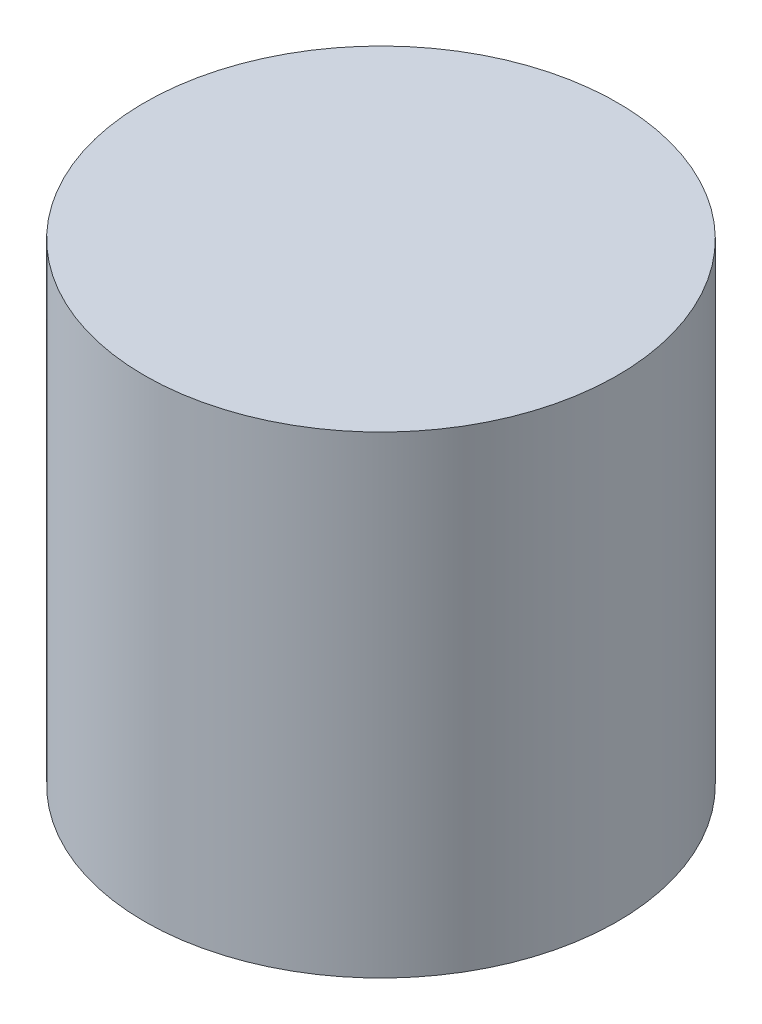
ISO-10303-21;
HEADER;
FILE_DESCRIPTION(('STEP AP214'),'2;1');
FILE_NAME('part.step','',(''),(''),'','','');
FILE_SCHEMA(('AUTOMOTIVE_DESIGN { 1 0 10303 214 1 1 1 1 }'));
ENDSEC;
DATA;
#1=APPLICATION_CONTEXT('core data for automotive mechanical design processes');
#2=APPLICATION_PROTOCOL_DEFINITION('international standard','automotive_design',2000,#1);
#3=PRODUCT_CONTEXT('',#1,'mechanical');
#4=PRODUCT('Part','Part','',(#3));
#5=PRODUCT_RELATED_PRODUCT_CATEGORY('part','',(#4));
#6=PRODUCT_DEFINITION_FORMATION('','',#4);
#7=PRODUCT_DEFINITION_CONTEXT('part definition',#1,'design');
#8=PRODUCT_DEFINITION('design','',#6,#7);
#9=PRODUCT_DEFINITION_SHAPE('','',#8);
#10=(LENGTH_UNIT() NAMED_UNIT(*) SI_UNIT(.MILLI.,.METRE.));
#11=(NAMED_UNIT(*) PLANE_ANGLE_UNIT() SI_UNIT($,.RADIAN.));
#12=(NAMED_UNIT(*) SI_UNIT($,.STERADIAN.) SOLID_ANGLE_UNIT());
#13=UNCERTAINTY_MEASURE_WITH_UNIT(LENGTH_MEASURE(1.E-05),#10,'distance_accuracy_value','');
#14=(GEOMETRIC_REPRESENTATION_CONTEXT(3) GLOBAL_UNCERTAINTY_ASSIGNED_CONTEXT((#13)) GLOBAL_UNIT_ASSIGNED_CONTEXT((#10,
#11,#12)) REPRESENTATION_CONTEXT('',''));
#15=CARTESIAN_POINT('',(0.,0.,0.));
#16=DIRECTION('',(0.,0.,1.));
#17=DIRECTION('',(1.,0.,0.));
#18=AXIS2_PLACEMENT_3D('',#15,#16,#17);
#19=CARTESIAN_POINT('',(0.,12.7,0.));
#20=DIRECTION('',(0.,-1.,0.));
#21=DIRECTION('',(0.,0.,-1.));
#22=AXIS2_PLACEMENT_3D('',#19,#20,#21);
#23=CYLINDRICAL_SURFACE('',#22,12.7);
#24=CARTESIAN_POINT('',(0.,12.7,0.));
#25=DIRECTION('',(0.,1.,0.));
#26=DIRECTION('',(0.,0.,1.));
#27=AXIS2_PLACEMENT_3D('',#24,#25,#26);
#28=CIRCLE('',#27,12.7);
#29=CARTESIAN_POINT('',(0.,12.7,12.7));
#30=VERTEX_POINT('',#29);
#31=EDGE_CURVE('E10',#30,#30,#28,.T.);
#32=ORIENTED_EDGE('',*,*,#31,.F.);
#33=EDGE_LOOP('',(#32));
#34=FACE_BOUND('',#33,.T.);
#35=CARTESIAN_POINT('',(0.,-12.7,0.));
#36=DIRECTION('',(0.,1.,0.));
#37=DIRECTION('',(0.,0.,1.));
#38=AXIS2_PLACEMENT_3D('',#35,#36,#37);
#39=CIRCLE('',#38,12.7);
#40=CARTESIAN_POINT('',(0.,-12.7,12.7));
#41=VERTEX_POINT('',#40);
#42=EDGE_CURVE('E34',#41,#41,#39,.T.);
#43=ORIENTED_EDGE('',*,*,#42,.T.);
#44=EDGE_LOOP('',(#43));
#45=FACE_BOUND('',#44,.T.);
#46=ADVANCED_FACE('F31',(#34,#45),#23,.T.);
#47=CARTESIAN_POINT('',(0.,12.7,0.));
#48=DIRECTION('',(0.,1.,0.));
#49=DIRECTION('',(0.,0.,1.));
#50=AXIS2_PLACEMENT_3D('',#47,#48,#49);
#51=PLANE('',#50);
#52=ORIENTED_EDGE('',*,*,#31,.T.);
#53=EDGE_LOOP('',(#52));
#54=FACE_BOUND('',#53,.T.);
#55=ADVANCED_FACE('F46',(#54),#51,.T.);
#56=CARTESIAN_POINT('',(0.,-12.7,0.));
#57=DIRECTION('',(0.,1.,0.));
#58=DIRECTION('',(0.,0.,1.));
#59=AXIS2_PLACEMENT_3D('',#56,#57,#58);
#60=PLANE('',#59);
#61=ORIENTED_EDGE('',*,*,#42,.F.);
#62=EDGE_LOOP('',(#61));
#63=FACE_BOUND('',#62,.T.);
#64=ADVANCED_FACE('F44',(#63),#60,.F.);
#65=CLOSED_SHELL('',(#46,#55,#64));
#66=MANIFOLD_SOLID_BREP('B2',#65);
#67=ADVANCED_BREP_SHAPE_REPRESENTATION('',(#18,#66),#14);
#68=SHAPE_DEFINITION_REPRESENTATION(#9,#67);
ENDSEC;
END-ISO-10303-21;
